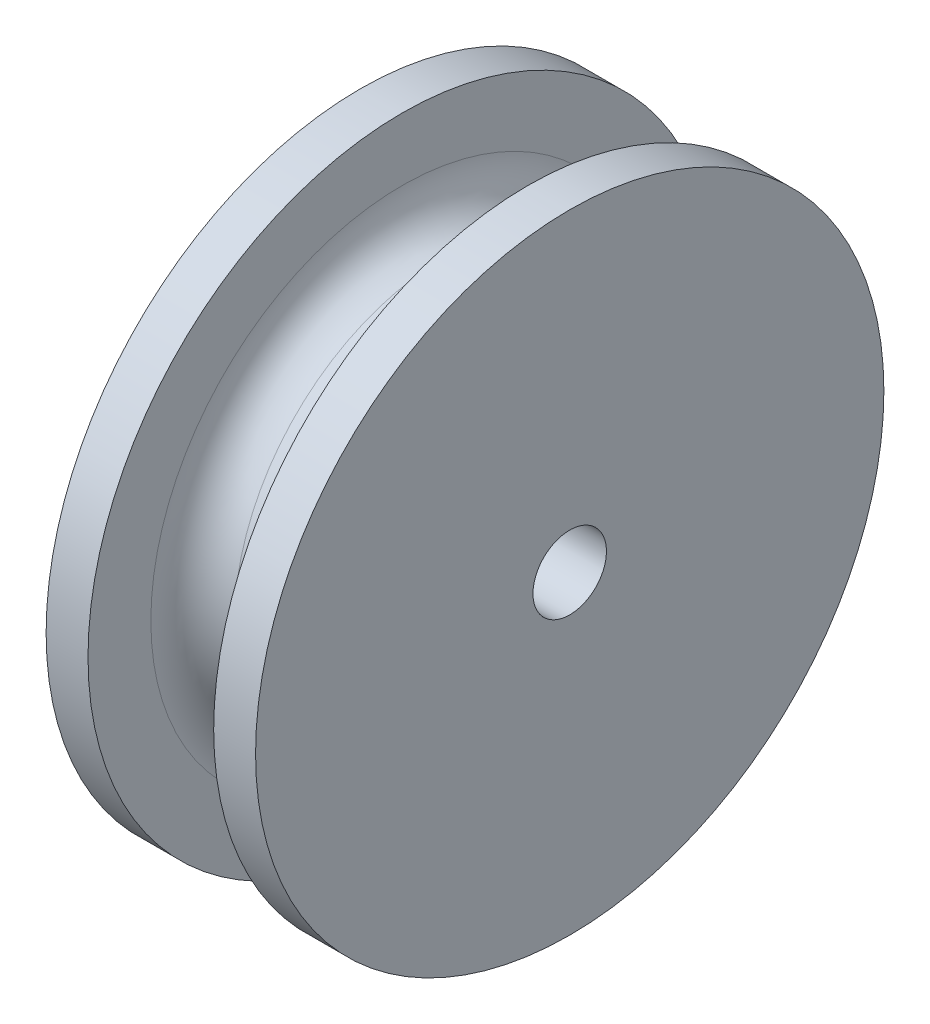
ISO-10303-21;
HEADER;
FILE_DESCRIPTION(('STEP AP214'),'2;1');
FILE_NAME('part.step','',(''),(''),'','','');
FILE_SCHEMA(('AUTOMOTIVE_DESIGN { 1 0 10303 214 1 1 1 1 }'));
ENDSEC;
DATA;
#1=APPLICATION_CONTEXT('core data for automotive mechanical design processes');
#2=APPLICATION_PROTOCOL_DEFINITION('international standard','automotive_design',2000,#1);
#3=PRODUCT_CONTEXT('',#1,'mechanical');
#4=PRODUCT('Part','Part','',(#3));
#5=PRODUCT_RELATED_PRODUCT_CATEGORY('part','',(#4));
#6=PRODUCT_DEFINITION_FORMATION('','',#4);
#7=PRODUCT_DEFINITION_CONTEXT('part definition',#1,'design');
#8=PRODUCT_DEFINITION('design','',#6,#7);
#9=PRODUCT_DEFINITION_SHAPE('','',#8);
#10=(LENGTH_UNIT() NAMED_UNIT(*) SI_UNIT(.MILLI.,.METRE.));
#11=(NAMED_UNIT(*) PLANE_ANGLE_UNIT() SI_UNIT($,.RADIAN.));
#12=(NAMED_UNIT(*) SI_UNIT($,.STERADIAN.) SOLID_ANGLE_UNIT());
#13=UNCERTAINTY_MEASURE_WITH_UNIT(LENGTH_MEASURE(1.E-05),#10,'distance_accuracy_value','');
#14=(GEOMETRIC_REPRESENTATION_CONTEXT(3) GLOBAL_UNCERTAINTY_ASSIGNED_CONTEXT((#13)) GLOBAL_UNIT_ASSIGNED_CONTEXT((#10,
#11,#12)) REPRESENTATION_CONTEXT('',''));
#15=CARTESIAN_POINT('',(0.,0.,0.));
#16=DIRECTION('',(0.,0.,1.));
#17=DIRECTION('',(1.,0.,0.));
#18=AXIS2_PLACEMENT_3D('',#15,#16,#17);
#19=CARTESIAN_POINT('',(-9.24170616113745,0.,0.));
#20=DIRECTION('',(-1.,0.,0.));
#21=DIRECTION('',(0.,0.,1.));
#22=AXIS2_PLACEMENT_3D('',#19,#20,#21);
#23=CYLINDRICAL_SURFACE('',#22,15.);
#24=CARTESIAN_POINT('',(3.,0.,0.));
#25=DIRECTION('',(-1.,0.,0.));
#26=DIRECTION('',(0.,0.,1.));
#27=AXIS2_PLACEMENT_3D('',#24,#25,#26);
#28=CIRCLE('',#27,15.);
#29=CARTESIAN_POINT('',(3.,0.,15.));
#30=VERTEX_POINT('',#29);
#31=EDGE_CURVE('E90',#30,#30,#28,.T.);
#32=ORIENTED_EDGE('',*,*,#31,.F.);
#33=EDGE_LOOP('',(#32));
#34=FACE_BOUND('',#33,.T.);
#35=CARTESIAN_POINT('',(5.,0.,0.));
#36=DIRECTION('',(-1.,0.,0.));
#37=DIRECTION('',(0.,0.,1.));
#38=AXIS2_PLACEMENT_3D('',#35,#36,#37);
#39=CIRCLE('',#38,15.);
#40=CARTESIAN_POINT('',(5.,0.,15.));
#41=VERTEX_POINT('',#40);
#42=EDGE_CURVE('E12',#41,#41,#39,.T.);
#43=ORIENTED_EDGE('',*,*,#42,.T.);
#44=EDGE_LOOP('',(#43));
#45=FACE_BOUND('',#44,.T.);
#46=ADVANCED_FACE('F47',(#34,#45),#23,.T.);
#47=CARTESIAN_POINT('',(5.,15.,0.));
#48=DIRECTION('',(-1.,0.,0.));
#49=DIRECTION('',(0.,0.,1.));
#50=AXIS2_PLACEMENT_3D('',#47,#48,#49);
#51=PLANE('',#50);
#52=ORIENTED_EDGE('',*,*,#42,.F.);
#53=EDGE_LOOP('',(#52));
#54=FACE_BOUND('',#53,.T.);
#55=CARTESIAN_POINT('',(5.,0.,0.));
#56=DIRECTION('',(-1.,0.,0.));
#57=DIRECTION('',(0.,0.,1.));
#58=AXIS2_PLACEMENT_3D('',#55,#56,#57);
#59=CIRCLE('',#58,1.75355450236967);
#60=CARTESIAN_POINT('',(5.,0.,1.75355450236967));
#61=VERTEX_POINT('',#60);
#62=EDGE_CURVE('E54',#61,#61,#59,.T.);
#63=ORIENTED_EDGE('',*,*,#62,.T.);
#64=EDGE_LOOP('',(#63));
#65=FACE_BOUND('',#64,.T.);
#66=ADVANCED_FACE('F98',(#54,#65),#51,.F.);
#67=CARTESIAN_POINT('',(-9.24170616113745,0.,0.));
#68=DIRECTION('',(-1.,0.,0.));
#69=DIRECTION('',(0.,0.,1.));
#70=AXIS2_PLACEMENT_3D('',#67,#68,#69);
#71=CYLINDRICAL_SURFACE('',#70,1.75355450236967);
#72=ORIENTED_EDGE('',*,*,#62,.F.);
#73=EDGE_LOOP('',(#72));
#74=FACE_BOUND('',#73,.T.);
#75=CARTESIAN_POINT('',(-5.,0.,0.));
#76=DIRECTION('',(-1.,0.,0.));
#77=DIRECTION('',(0.,0.,1.));
#78=AXIS2_PLACEMENT_3D('',#75,#76,#77);
#79=CIRCLE('',#78,1.75355450236967);
#80=CARTESIAN_POINT('',(-5.,0.,1.75355450236967));
#81=VERTEX_POINT('',#80);
#82=EDGE_CURVE('E59',#81,#81,#79,.T.);
#83=ORIENTED_EDGE('',*,*,#82,.T.);
#84=EDGE_LOOP('',(#83));
#85=FACE_BOUND('',#84,.T.);
#86=ADVANCED_FACE('F102',(#74,#85),#71,.F.);
#87=CARTESIAN_POINT('',(-5.,1.75355450236967,0.));
#88=DIRECTION('',(1.,0.,0.));
#89=DIRECTION('',(0.,0.,-1.));
#90=AXIS2_PLACEMENT_3D('',#87,#88,#89);
#91=PLANE('',#90);
#92=ORIENTED_EDGE('',*,*,#82,.F.);
#93=EDGE_LOOP('',(#92));
#94=FACE_BOUND('',#93,.T.);
#95=CARTESIAN_POINT('',(-5.,0.,0.));
#96=DIRECTION('',(-1.,0.,0.));
#97=DIRECTION('',(0.,0.,1.));
#98=AXIS2_PLACEMENT_3D('',#95,#96,#97);
#99=CIRCLE('',#98,15.);
#100=CARTESIAN_POINT('',(-5.,0.,15.));
#101=VERTEX_POINT('',#100);
#102=EDGE_CURVE('E64',#101,#101,#99,.T.);
#103=ORIENTED_EDGE('',*,*,#102,.T.);
#104=EDGE_LOOP('',(#103));
#105=FACE_BOUND('',#104,.T.);
#106=ADVANCED_FACE('F107',(#94,#105),#91,.F.);
#107=CARTESIAN_POINT('',(-9.24170616113745,0.,0.));
#108=DIRECTION('',(-1.,0.,0.));
#109=DIRECTION('',(0.,0.,1.));
#110=AXIS2_PLACEMENT_3D('',#107,#108,#109);
#111=CYLINDRICAL_SURFACE('',#110,15.);
#112=ORIENTED_EDGE('',*,*,#102,.F.);
#113=EDGE_LOOP('',(#112));
#114=FACE_BOUND('',#113,.T.);
#115=CARTESIAN_POINT('',(-3.,0.,0.));
#116=DIRECTION('',(-1.,0.,0.));
#117=DIRECTION('',(0.,0.,1.));
#118=AXIS2_PLACEMENT_3D('',#115,#116,#117);
#119=CIRCLE('',#118,15.);
#120=CARTESIAN_POINT('',(-3.,0.,15.));
#121=VERTEX_POINT('',#120);
#122=EDGE_CURVE('E70',#121,#121,#119,.T.);
#123=ORIENTED_EDGE('',*,*,#122,.T.);
#124=EDGE_LOOP('',(#123));
#125=FACE_BOUND('',#124,.T.);
#126=ADVANCED_FACE('F113',(#114,#125),#111,.T.);
#127=CARTESIAN_POINT('',(-3.,15.,0.));
#128=DIRECTION('',(-1.,0.,0.));
#129=DIRECTION('',(0.,0.,1.));
#130=AXIS2_PLACEMENT_3D('',#127,#128,#129);
#131=PLANE('',#130);
#132=ORIENTED_EDGE('',*,*,#122,.F.);
#133=EDGE_LOOP('',(#132));
#134=FACE_BOUND('',#133,.T.);
#135=CARTESIAN_POINT('',(-3.,0.,0.));
#136=DIRECTION('',(-1.,0.,0.));
#137=DIRECTION('',(0.,0.,1.));
#138=AXIS2_PLACEMENT_3D('',#135,#136,#137);
#139=CIRCLE('',#138,12.);
#140=CARTESIAN_POINT('',(-3.,0.,12.));
#141=VERTEX_POINT('',#140);
#142=EDGE_CURVE('E74',#141,#141,#139,.T.);
#143=ORIENTED_EDGE('',*,*,#142,.T.);
#144=EDGE_LOOP('',(#143));
#145=FACE_BOUND('',#144,.T.);
#146=ADVANCED_FACE('F117',(#134,#145),#131,.F.);
#147=CARTESIAN_POINT('',(-0.999999999999998,0.,0.));
#148=DIRECTION('',(-1.,0.,0.));
#149=DIRECTION('',(0.,0.,1.));
#150=AXIS2_PLACEMENT_3D('',#147,#148,#149);
#151=TOROIDAL_SURFACE('',#150,12.,2.);
#152=ORIENTED_EDGE('',*,*,#142,.F.);
#153=EDGE_LOOP('',(#152));
#154=FACE_BOUND('',#153,.T.);
#155=CARTESIAN_POINT('',(-0.999999999999984,0.,0.));
#156=DIRECTION('',(-1.,0.,0.));
#157=DIRECTION('',(0.,0.,1.));
#158=AXIS2_PLACEMENT_3D('',#155,#156,#157);
#159=CIRCLE('',#158,10.);
#160=CARTESIAN_POINT('',(-0.999999999999984,0.,10.));
#161=VERTEX_POINT('',#160);
#162=EDGE_CURVE('E78',#161,#161,#159,.T.);
#163=ORIENTED_EDGE('',*,*,#162,.T.);
#164=EDGE_LOOP('',(#163));
#165=FACE_BOUND('',#164,.T.);
#166=ADVANCED_FACE('F121',(#154,#165),#151,.F.);
#167=CARTESIAN_POINT('',(-9.24170616113745,0.,0.));
#168=DIRECTION('',(-1.,0.,0.));
#169=DIRECTION('',(0.,0.,1.));
#170=AXIS2_PLACEMENT_3D('',#167,#168,#169);
#171=CYLINDRICAL_SURFACE('',#170,10.);
#172=ORIENTED_EDGE('',*,*,#162,.F.);
#173=EDGE_LOOP('',(#172));
#174=FACE_BOUND('',#173,.T.);
#175=CARTESIAN_POINT('',(0.999999999999984,0.,0.));
#176=DIRECTION('',(-1.,0.,0.));
#177=DIRECTION('',(0.,0.,1.));
#178=AXIS2_PLACEMENT_3D('',#175,#176,#177);
#179=CIRCLE('',#178,10.);
#180=CARTESIAN_POINT('',(0.999999999999984,0.,10.));
#181=VERTEX_POINT('',#180);
#182=EDGE_CURVE('E82',#181,#181,#179,.T.);
#183=ORIENTED_EDGE('',*,*,#182,.T.);
#184=EDGE_LOOP('',(#183));
#185=FACE_BOUND('',#184,.T.);
#186=ADVANCED_FACE('F125',(#174,#185),#171,.T.);
#187=CARTESIAN_POINT('',(0.999999999999997,0.,0.));
#188=DIRECTION('',(-1.,0.,0.));
#189=DIRECTION('',(0.,0.,1.));
#190=AXIS2_PLACEMENT_3D('',#187,#188,#189);
#191=TOROIDAL_SURFACE('',#190,12.,2.);
#192=ORIENTED_EDGE('',*,*,#182,.F.);
#193=EDGE_LOOP('',(#192));
#194=FACE_BOUND('',#193,.T.);
#195=CARTESIAN_POINT('',(3.,0.,0.));
#196=DIRECTION('',(-1.,0.,0.));
#197=DIRECTION('',(0.,0.,1.));
#198=AXIS2_PLACEMENT_3D('',#195,#196,#197);
#199=CIRCLE('',#198,12.);
#200=CARTESIAN_POINT('',(3.,0.,12.));
#201=VERTEX_POINT('',#200);
#202=EDGE_CURVE('E86',#201,#201,#199,.T.);
#203=ORIENTED_EDGE('',*,*,#202,.T.);
#204=EDGE_LOOP('',(#203));
#205=FACE_BOUND('',#204,.T.);
#206=ADVANCED_FACE('F129',(#194,#205),#191,.F.);
#207=CARTESIAN_POINT('',(3.,12.,0.));
#208=DIRECTION('',(1.,0.,0.));
#209=DIRECTION('',(0.,0.,-1.));
#210=AXIS2_PLACEMENT_3D('',#207,#208,#209);
#211=PLANE('',#210);
#212=ORIENTED_EDGE('',*,*,#202,.F.);
#213=EDGE_LOOP('',(#212));
#214=FACE_BOUND('',#213,.T.);
#215=ORIENTED_EDGE('',*,*,#31,.T.);
#216=EDGE_LOOP('',(#215));
#217=FACE_BOUND('',#216,.T.);
#218=ADVANCED_FACE('F95',(#214,#217),#211,.F.);
#219=CLOSED_SHELL('',(#46,#66,#86,#106,#126,#146,#166,#186,#206,#218));
#220=MANIFOLD_SOLID_BREP('B2',#219);
#221=ADVANCED_BREP_SHAPE_REPRESENTATION('',(#18,#220),#14);
#222=SHAPE_DEFINITION_REPRESENTATION(#9,#221);
ENDSEC;
END-ISO-10303-21;
